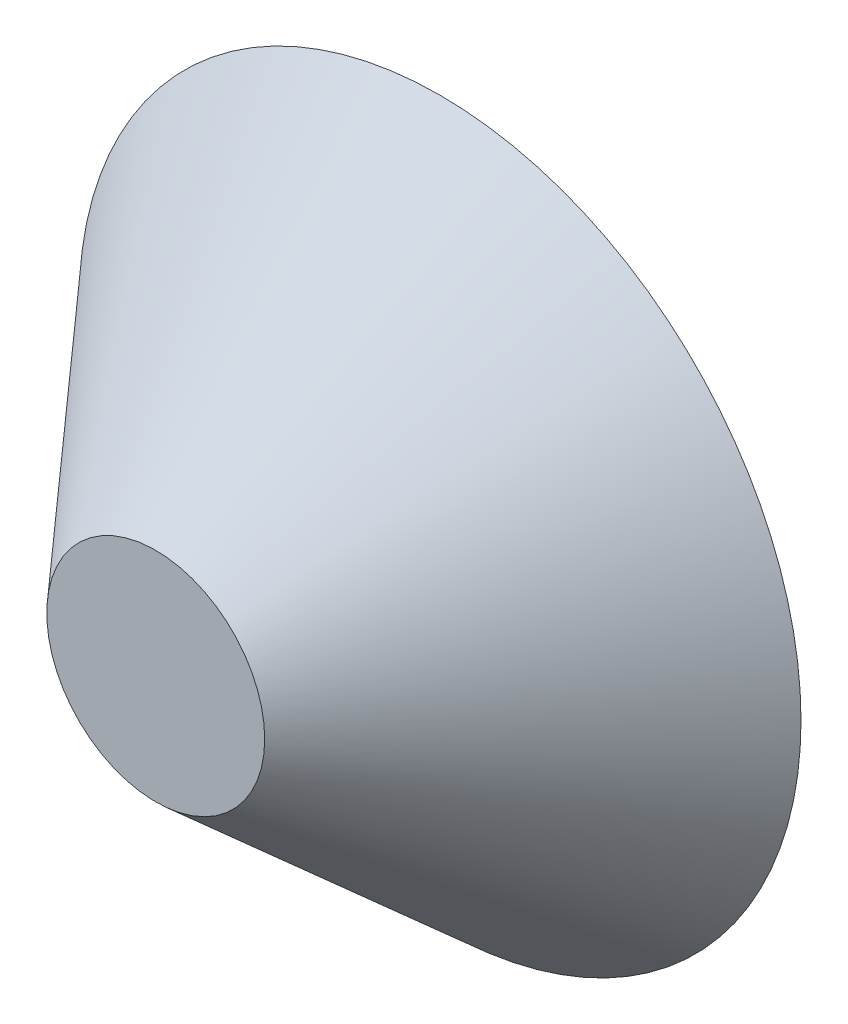
ISO-10303-21;
HEADER;
FILE_DESCRIPTION(('STEP AP214'),'2;1');
FILE_NAME('part.step','',(''),(''),'','','');
FILE_SCHEMA(('AUTOMOTIVE_DESIGN { 1 0 10303 214 1 1 1 1 }'));
ENDSEC;
DATA;
#1=APPLICATION_CONTEXT('core data for automotive mechanical design processes');
#2=APPLICATION_PROTOCOL_DEFINITION('international standard','automotive_design',2000,#1);
#3=PRODUCT_CONTEXT('',#1,'mechanical');
#4=PRODUCT('Part','Part','',(#3));
#5=PRODUCT_RELATED_PRODUCT_CATEGORY('part','',(#4));
#6=PRODUCT_DEFINITION_FORMATION('','',#4);
#7=PRODUCT_DEFINITION_CONTEXT('part definition',#1,'design');
#8=PRODUCT_DEFINITION('design','',#6,#7);
#9=PRODUCT_DEFINITION_SHAPE('','',#8);
#10=(LENGTH_UNIT() NAMED_UNIT(*) SI_UNIT(.MILLI.,.METRE.));
#11=(NAMED_UNIT(*) PLANE_ANGLE_UNIT() SI_UNIT($,.RADIAN.));
#12=(NAMED_UNIT(*) SI_UNIT($,.STERADIAN.) SOLID_ANGLE_UNIT());
#13=UNCERTAINTY_MEASURE_WITH_UNIT(LENGTH_MEASURE(1.E-05),#10,'distance_accuracy_value','');
#14=(GEOMETRIC_REPRESENTATION_CONTEXT(3) GLOBAL_UNCERTAINTY_ASSIGNED_CONTEXT((#13)) GLOBAL_UNIT_ASSIGNED_CONTEXT((#10,
#11,#12)) REPRESENTATION_CONTEXT('',''));
#15=CARTESIAN_POINT('',(0.,0.,0.));
#16=DIRECTION('',(0.,0.,1.));
#17=DIRECTION('',(1.,0.,0.));
#18=AXIS2_PLACEMENT_3D('',#15,#16,#17);
#19=CARTESIAN_POINT('',(0.,0.,30.));
#20=DIRECTION('',(0.,0.,1.));
#21=DIRECTION('',(1.,0.,0.));
#22=AXIS2_PLACEMENT_3D('',#19,#20,#21);
#23=PLANE('',#22);
#24=CARTESIAN_POINT('',(0.,0.,30.));
#25=DIRECTION('',(0.,0.,1.));
#26=DIRECTION('',(1.,0.,0.));
#27=AXIS2_PLACEMENT_3D('',#24,#25,#26);
#28=CIRCLE('',#27,11.5);
#29=CARTESIAN_POINT('',(11.5,0.,30.));
#30=VERTEX_POINT('',#29);
#31=EDGE_CURVE('E11',#30,#30,#28,.T.);
#32=ORIENTED_EDGE('',*,*,#31,.T.);
#33=EDGE_LOOP('',(#32));
#34=FACE_BOUND('',#33,.T.);
#35=ADVANCED_FACE('F45',(#34),#23,.T.);
#36=CARTESIAN_POINT('',(0.,0.,0.));
#37=DIRECTION('',(0.,0.,1.));
#38=DIRECTION('',(1.,0.,0.));
#39=AXIS2_PLACEMENT_3D('',#36,#37,#38);
#40=PLANE('',#39);
#41=CARTESIAN_POINT('',(0.,0.,0.));
#42=DIRECTION('',(0.,0.,1.));
#43=DIRECTION('',(1.,0.,0.));
#44=AXIS2_PLACEMENT_3D('',#41,#42,#43);
#45=CIRCLE('',#44,38.1);
#46=CARTESIAN_POINT('',(38.1,0.,0.));
#47=VERTEX_POINT('',#46);
#48=EDGE_CURVE('E54',#47,#47,#45,.T.);
#49=ORIENTED_EDGE('',*,*,#48,.F.);
#50=EDGE_LOOP('',(#49));
#51=FACE_BOUND('',#50,.T.);
#52=ADVANCED_FACE('F78',(#51),#40,.F.);
#53=CARTESIAN_POINT('',(0.,0.,30.));
#54=DIRECTION('',(0.,0.,-1.));
#55=DIRECTION('',(-1.,0.,0.));
#56=AXIS2_PLACEMENT_3D('',#53,#54,#55);
#57=CONICAL_SURFACE('',#56,11.5,0.72539959070013);
#58=ORIENTED_EDGE('',*,*,#48,.T.);
#59=EDGE_LOOP('',(#58));
#60=FACE_BOUND('',#59,.T.);
#61=ORIENTED_EDGE('',*,*,#31,.F.);
#62=EDGE_LOOP('',(#61));
#63=FACE_BOUND('',#62,.T.);
#64=ADVANCED_FACE('F86',(#60,#63),#57,.T.);
#65=CLOSED_SHELL('',(#35,#52,#64));
#66=MANIFOLD_SOLID_BREP('B2',#65);
#67=ADVANCED_BREP_SHAPE_REPRESENTATION('',(#18,#66),#14);
#68=SHAPE_DEFINITION_REPRESENTATION(#9,#67);
ENDSEC;
END-ISO-10303-21;
